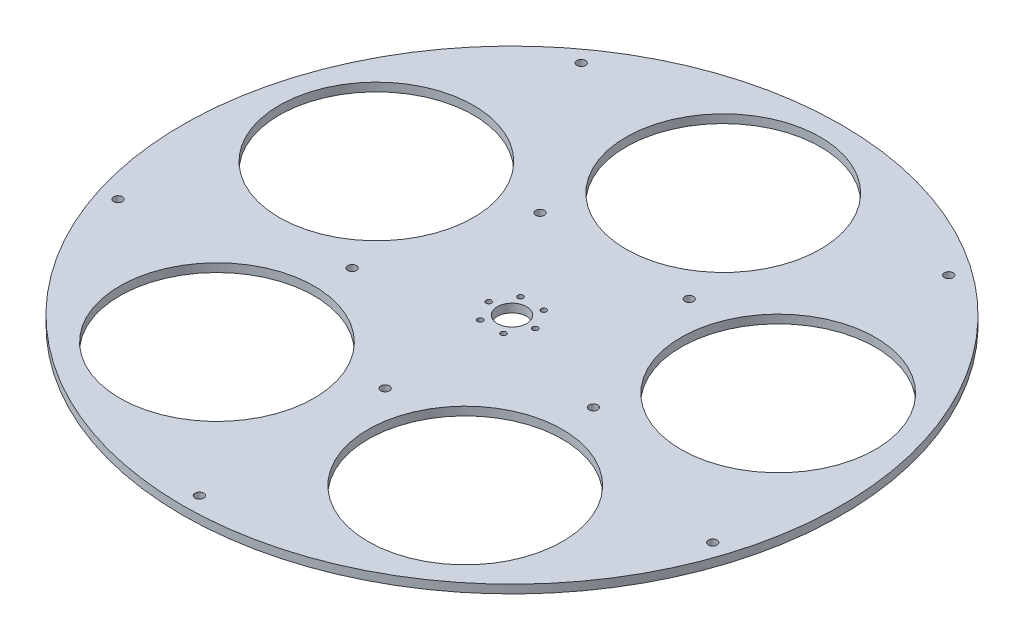
ISO-10303-21;
HEADER;
FILE_DESCRIPTION(('STEP AP214'),'2;1');
FILE_NAME('part.step','',(''),(''),'','','');
FILE_SCHEMA(('AUTOMOTIVE_DESIGN { 1 0 10303 214 1 1 1 1 }'));
ENDSEC;
DATA;
#1=APPLICATION_CONTEXT('core data for automotive mechanical design processes');
#2=APPLICATION_PROTOCOL_DEFINITION('international standard','automotive_design',2000,#1);
#3=PRODUCT_CONTEXT('',#1,'mechanical');
#4=PRODUCT('Part','Part','',(#3));
#5=PRODUCT_RELATED_PRODUCT_CATEGORY('part','',(#4));
#6=PRODUCT_DEFINITION_FORMATION('','',#4);
#7=PRODUCT_DEFINITION_CONTEXT('part definition',#1,'design');
#8=PRODUCT_DEFINITION('design','',#6,#7);
#9=PRODUCT_DEFINITION_SHAPE('','',#8);
#10=(LENGTH_UNIT() NAMED_UNIT(*) SI_UNIT(.MILLI.,.METRE.));
#11=(NAMED_UNIT(*) PLANE_ANGLE_UNIT() SI_UNIT($,.RADIAN.));
#12=(NAMED_UNIT(*) SI_UNIT($,.STERADIAN.) SOLID_ANGLE_UNIT());
#13=UNCERTAINTY_MEASURE_WITH_UNIT(LENGTH_MEASURE(1.E-05),#10,'distance_accuracy_value','');
#14=(GEOMETRIC_REPRESENTATION_CONTEXT(3) GLOBAL_UNCERTAINTY_ASSIGNED_CONTEXT((#13)) GLOBAL_UNIT_ASSIGNED_CONTEXT((#10,
#11,#12)) REPRESENTATION_CONTEXT('',''));
#15=CARTESIAN_POINT('',(0.,0.,0.));
#16=DIRECTION('',(0.,0.,1.));
#17=DIRECTION('',(1.,0.,0.));
#18=AXIS2_PLACEMENT_3D('',#15,#16,#17);
#19=CARTESIAN_POINT('',(0.,6.35,0.));
#20=DIRECTION('',(0.,1.,0.));
#21=DIRECTION('',(0.,0.,1.));
#22=AXIS2_PLACEMENT_3D('',#19,#20,#21);
#23=PLANE('',#22);
#24=CARTESIAN_POINT('',(90.6726821014121,6.35,29.4613403250134));
#25=DIRECTION('',(0.,1.,0.));
#26=DIRECTION('',(0.951056516295155,0.,0.309016994374945));
#27=AXIS2_PLACEMENT_3D('',#24,#25,#26);
#28=CIRCLE('',#27,3.2639);
#29=CARTESIAN_POINT('',(93.7768354649479,6.35,30.4699408929538));
#30=VERTEX_POINT('',#29);
#31=EDGE_CURVE('E178',#30,#30,#28,.T.);
#32=ORIENTED_EDGE('',*,*,#31,.F.);
#33=EDGE_LOOP('',(#32));
#34=FACE_BOUND('',#33,.T.);
#35=CARTESIAN_POINT('',(56.0387993897864,6.35,-77.130790325014));
#36=DIRECTION('',(0.,1.,0.));
#37=DIRECTION('',(0.587785252292469,0.,-0.809016994374951));
#38=AXIS2_PLACEMENT_3D('',#35,#36,#37);
#39=CIRCLE('',#38,3.2639);
#40=CARTESIAN_POINT('',(57.9572716747438,6.35,-79.7713408929544));
#41=VERTEX_POINT('',#40);
#42=EDGE_CURVE('E172',#41,#41,#39,.T.);
#43=ORIENTED_EDGE('',*,*,#42,.F.);
#44=EDGE_LOOP('',(#43));
#45=FACE_BOUND('',#44,.T.);
#46=CARTESIAN_POINT('',(-56.0387993897875,6.35,-77.1307903250132));
#47=DIRECTION('',(0.,1.,0.));
#48=DIRECTION('',(-0.58778525229248,0.,-0.809016994374942));
#49=AXIS2_PLACEMENT_3D('',#46,#47,#48);
#50=CIRCLE('',#49,3.2639);
#51=CARTESIAN_POINT('',(-57.957271674745,6.35,-79.7713408929535));
#52=VERTEX_POINT('',#51);
#53=EDGE_CURVE('E166',#52,#52,#50,.T.);
#54=ORIENTED_EDGE('',*,*,#53,.F.);
#55=EDGE_LOOP('',(#54));
#56=FACE_BOUND('',#55,.T.);
#57=CARTESIAN_POINT('',(-90.6726821014117,6.35,29.4613403250147));
#58=DIRECTION('',(0.,1.,0.));
#59=DIRECTION('',(-0.95105651629515,0.,0.309016994374958));
#60=AXIS2_PLACEMENT_3D('',#57,#58,#59);
#61=CIRCLE('',#60,3.2639);
#62=CARTESIAN_POINT('',(-93.7768354649474,6.35,30.4699408929551));
#63=VERTEX_POINT('',#62);
#64=EDGE_CURVE('E160',#63,#63,#61,.T.);
#65=ORIENTED_EDGE('',*,*,#64,.F.);
#66=EDGE_LOOP('',(#65));
#67=FACE_BOUND('',#66,.T.);
#68=CARTESIAN_POINT('',(0.,6.35,95.3389));
#69=DIRECTION('',(0.,1.,0.));
#70=DIRECTION('',(0.,0.,1.));
#71=AXIS2_PLACEMENT_3D('',#68,#69,#70);
#72=CIRCLE('',#71,3.2639);
#73=CARTESIAN_POINT('',(0.,6.35,98.6028));
#74=VERTEX_POINT('',#73);
#75=EDGE_CURVE('E154',#74,#74,#72,.T.);
#76=ORIENTED_EDGE('',*,*,#75,.F.);
#77=EDGE_LOOP('',(#76));
#78=FACE_BOUND('',#77,.T.);
#79=CARTESIAN_POINT('',(0.,6.35,234.95));
#80=DIRECTION('',(0.,1.,0.));
#81=DIRECTION('',(0.,0.,1.));
#82=AXIS2_PLACEMENT_3D('',#79,#80,#81);
#83=CIRCLE('',#82,3.2512);
#84=CARTESIAN_POINT('',(0.,6.35,238.2012));
#85=VERTEX_POINT('',#84);
#86=EDGE_CURVE('E149',#85,#85,#83,.T.);
#87=ORIENTED_EDGE('',*,*,#86,.F.);
#88=EDGE_LOOP('',(#87));
#89=FACE_BOUND('',#88,.T.);
#90=CARTESIAN_POINT('',(-223.450728503546,6.35,72.6035428283939));
#91=DIRECTION('',(0.,1.,0.));
#92=DIRECTION('',(0.,0.,1.));
#93=AXIS2_PLACEMENT_3D('',#90,#91,#92);
#94=CIRCLE('',#93,3.25120000000001);
#95=CARTESIAN_POINT('',(-223.450728503546,6.35,75.8547428283939));
#96=VERTEX_POINT('',#95);
#97=EDGE_CURVE('E143',#96,#96,#94,.T.);
#98=ORIENTED_EDGE('',*,*,#97,.F.);
#99=EDGE_LOOP('',(#98));
#100=FACE_BOUND('',#99,.T.);
#101=CARTESIAN_POINT('',(-138.100145026117,6.35,-190.078542828394));
#102=DIRECTION('',(0.,1.,0.));
#103=DIRECTION('',(0.,0.,1.));
#104=AXIS2_PLACEMENT_3D('',#101,#102,#103);
#105=CIRCLE('',#104,3.25120000000001);
#106=CARTESIAN_POINT('',(-138.100145026117,6.35,-186.827342828394));
#107=VERTEX_POINT('',#106);
#108=EDGE_CURVE('E137',#107,#107,#105,.T.);
#109=ORIENTED_EDGE('',*,*,#108,.F.);
#110=EDGE_LOOP('',(#109));
#111=FACE_BOUND('',#110,.T.);
#112=CARTESIAN_POINT('',(138.100145026117,6.35,-190.078542828394));
#113=DIRECTION('',(0.,1.,0.));
#114=DIRECTION('',(0.,0.,1.));
#115=AXIS2_PLACEMENT_3D('',#112,#113,#114);
#116=CIRCLE('',#115,3.25119999999998);
#117=CARTESIAN_POINT('',(138.100145026117,6.35,-186.827342828394));
#118=VERTEX_POINT('',#117);
#119=EDGE_CURVE('E131',#118,#118,#116,.T.);
#120=ORIENTED_EDGE('',*,*,#119,.F.);
#121=EDGE_LOOP('',(#120));
#122=FACE_BOUND('',#121,.T.);
#123=CARTESIAN_POINT('',(223.450728503546,6.35,72.6035428283939));
#124=DIRECTION('',(0.,1.,0.));
#125=DIRECTION('',(0.,0.,1.));
#126=AXIS2_PLACEMENT_3D('',#123,#124,#125);
#127=CIRCLE('',#126,3.25120000000001);
#128=CARTESIAN_POINT('',(223.450728503546,6.35,75.8547428283939));
#129=VERTEX_POINT('',#128);
#130=EDGE_CURVE('E124',#129,#129,#127,.T.);
#131=ORIENTED_EDGE('',*,*,#130,.F.);
#132=EDGE_LOOP('',(#131));
#133=FACE_BOUND('',#132,.T.);
#134=CARTESIAN_POINT('',(-8.73125000000002,6.35,-15.1229686135857));
#135=DIRECTION('',(0.,1.,0.));
#136=DIRECTION('',(0.,0.,1.));
#137=AXIS2_PLACEMENT_3D('',#134,#135,#136);
#138=CIRCLE('',#137,2.0193);
#139=CARTESIAN_POINT('',(-8.73125000000002,6.35,-13.1036686135857));
#140=VERTEX_POINT('',#139);
#141=EDGE_CURVE('E120',#140,#140,#138,.T.);
#142=ORIENTED_EDGE('',*,*,#141,.F.);
#143=EDGE_LOOP('',(#142));
#144=FACE_BOUND('',#143,.T.);
#145=CARTESIAN_POINT('',(8.73124999999997,6.35,-15.1229686135858));
#146=DIRECTION('',(0.,1.,0.));
#147=DIRECTION('',(0.,0.,1.));
#148=AXIS2_PLACEMENT_3D('',#145,#146,#147);
#149=CIRCLE('',#148,2.0193);
#150=CARTESIAN_POINT('',(8.73124999999997,6.35,-13.1036686135858));
#151=VERTEX_POINT('',#150);
#152=EDGE_CURVE('E114',#151,#151,#149,.T.);
#153=ORIENTED_EDGE('',*,*,#152,.F.);
#154=EDGE_LOOP('',(#153));
#155=FACE_BOUND('',#154,.T.);
#156=CARTESIAN_POINT('',(17.4625,6.35,0.));
#157=DIRECTION('',(0.,1.,0.));
#158=DIRECTION('',(0.,0.,1.));
#159=AXIS2_PLACEMENT_3D('',#156,#157,#158);
#160=CIRCLE('',#159,2.0193);
#161=CARTESIAN_POINT('',(17.4625,6.35,2.01929999999997));
#162=VERTEX_POINT('',#161);
#163=EDGE_CURVE('E108',#162,#162,#160,.T.);
#164=ORIENTED_EDGE('',*,*,#163,.F.);
#165=EDGE_LOOP('',(#164));
#166=FACE_BOUND('',#165,.T.);
#167=CARTESIAN_POINT('',(8.73125000000002,6.35,15.1229686135857));
#168=DIRECTION('',(0.,1.,0.));
#169=DIRECTION('',(0.,0.,1.));
#170=AXIS2_PLACEMENT_3D('',#167,#168,#169);
#171=CIRCLE('',#170,2.0193);
#172=CARTESIAN_POINT('',(8.73125000000002,6.35,17.1422686135857));
#173=VERTEX_POINT('',#172);
#174=EDGE_CURVE('E102',#173,#173,#171,.T.);
#175=ORIENTED_EDGE('',*,*,#174,.F.);
#176=EDGE_LOOP('',(#175));
#177=FACE_BOUND('',#176,.T.);
#178=CARTESIAN_POINT('',(-8.73124999999997,6.35,15.1229686135858));
#179=DIRECTION('',(0.,1.,0.));
#180=DIRECTION('',(0.,0.,1.));
#181=AXIS2_PLACEMENT_3D('',#178,#179,#180);
#182=CIRCLE('',#181,2.0193);
#183=CARTESIAN_POINT('',(-8.73124999999997,6.35,17.1422686135858));
#184=VERTEX_POINT('',#183);
#185=EDGE_CURVE('E96',#184,#184,#182,.T.);
#186=ORIENTED_EDGE('',*,*,#185,.F.);
#187=EDGE_LOOP('',(#186));
#188=FACE_BOUND('',#187,.T.);
#189=CARTESIAN_POINT('',(-17.4625,6.35,0.));
#190=DIRECTION('',(0.,1.,0.));
#191=DIRECTION('',(0.,0.,1.));
#192=AXIS2_PLACEMENT_3D('',#189,#190,#191);
#193=CIRCLE('',#192,2.0193);
#194=CARTESIAN_POINT('',(-17.4625,6.35,2.01930000000002));
#195=VERTEX_POINT('',#194);
#196=EDGE_CURVE('E90',#195,#195,#193,.T.);
#197=ORIENTED_EDGE('',*,*,#196,.F.);
#198=EDGE_LOOP('',(#197));
#199=FACE_BOUND('',#198,.T.);
#200=CARTESIAN_POINT('',(0.,6.35,0.));
#201=DIRECTION('',(0.,1.,0.));
#202=DIRECTION('',(0.,0.,1.));
#203=AXIS2_PLACEMENT_3D('',#200,#201,#202);
#204=CIRCLE('',#203,11.);
#205=CARTESIAN_POINT('',(0.,6.35,11.));
#206=VERTEX_POINT('',#205);
#207=EDGE_CURVE('E82',#206,#206,#204,.T.);
#208=ORIENTED_EDGE('',*,*,#207,.F.);
#209=EDGE_LOOP('',(#208));
#210=FACE_BOUND('',#209,.T.);
#211=CARTESIAN_POINT('',(-93.3109088014179,6.35,128.431447857027));
#212=DIRECTION('',(0.,1.,0.));
#213=DIRECTION('',(0.,0.,1.));
#214=AXIS2_PLACEMENT_3D('',#211,#212,#213);
#215=CIRCLE('',#214,73.025);
#216=CARTESIAN_POINT('',(-93.3109088014179,6.35,201.456447857027));
#217=VERTEX_POINT('',#216);
#218=EDGE_CURVE('E67',#217,#217,#215,.T.);
#219=ORIENTED_EDGE('',*,*,#218,.F.);
#220=EDGE_LOOP('',(#219));
#221=FACE_BOUND('',#220,.T.);
#222=CARTESIAN_POINT('',(150.98022196186,6.35,-49.0564478570293));
#223=DIRECTION('',(0.,1.,0.));
#224=DIRECTION('',(0.,0.,1.));
#225=AXIS2_PLACEMENT_3D('',#222,#223,#224);
#226=CIRCLE('',#225,73.025);
#227=CARTESIAN_POINT('',(150.98022196186,6.35,23.9685521429707));
#228=VERTEX_POINT('',#227);
#229=EDGE_CURVE('E55',#228,#228,#226,.T.);
#230=ORIENTED_EDGE('',*,*,#229,.F.);
#231=EDGE_LOOP('',(#230));
#232=FACE_BOUND('',#231,.T.);
#233=CARTESIAN_POINT('',(0.,6.35,0.));
#234=DIRECTION('',(0.,1.,0.));
#235=DIRECTION('',(0.,0.,1.));
#236=AXIS2_PLACEMENT_3D('',#233,#234,#235);
#237=CIRCLE('',#236,247.65);
#238=CARTESIAN_POINT('',(0.,6.35,247.65));
#239=VERTEX_POINT('',#238);
#240=EDGE_CURVE('E10',#239,#239,#237,.T.);
#241=ORIENTED_EDGE('',*,*,#240,.T.);
#242=EDGE_LOOP('',(#241));
#243=FACE_BOUND('',#242,.T.);
#244=CARTESIAN_POINT('',(0.,6.35,-158.75));
#245=DIRECTION('',(0.,1.,0.));
#246=DIRECTION('',(0.,0.,1.));
#247=AXIS2_PLACEMENT_3D('',#244,#245,#246);
#248=CIRCLE('',#247,73.025);
#249=CARTESIAN_POINT('',(0.,6.35,-85.725));
#250=VERTEX_POINT('',#249);
#251=EDGE_CURVE('E50',#250,#250,#248,.T.);
#252=ORIENTED_EDGE('',*,*,#251,.F.);
#253=EDGE_LOOP('',(#252));
#254=FACE_BOUND('',#253,.T.);
#255=CARTESIAN_POINT('',(93.3109088014423,6.35,128.431447857019));
#256=DIRECTION('',(0.,1.,0.));
#257=DIRECTION('',(0.,0.,1.));
#258=AXIS2_PLACEMENT_3D('',#255,#256,#257);
#259=CIRCLE('',#258,73.025);
#260=CARTESIAN_POINT('',(93.3109088014423,6.35,201.456447857019));
#261=VERTEX_POINT('',#260);
#262=EDGE_CURVE('E61',#261,#261,#259,.T.);
#263=ORIENTED_EDGE('',*,*,#262,.F.);
#264=EDGE_LOOP('',(#263));
#265=FACE_BOUND('',#264,.T.);
#266=CARTESIAN_POINT('',(-150.980221961851,6.35,-49.0564478570165));
#267=DIRECTION('',(0.,1.,0.));
#268=DIRECTION('',(0.,0.,1.));
#269=AXIS2_PLACEMENT_3D('',#266,#267,#268);
#270=CIRCLE('',#269,73.025);
#271=CARTESIAN_POINT('',(-150.980221961851,6.35,23.9685521429835));
#272=VERTEX_POINT('',#271);
#273=EDGE_CURVE('E73',#272,#272,#270,.T.);
#274=ORIENTED_EDGE('',*,*,#273,.F.);
#275=EDGE_LOOP('',(#274));
#276=FACE_BOUND('',#275,.T.);
#277=ADVANCED_FACE('F39',(#34,#45,#56,#67,#78,#89,#100,#111,#122,#133,#144,#155,#166,#177,#188,
#199,#210,#221,#232,#243,#254,#265,#276),#23,.T.);
#278=CARTESIAN_POINT('',(0.,0.,0.));
#279=DIRECTION('',(0.,1.,0.));
#280=DIRECTION('',(0.,0.,1.));
#281=AXIS2_PLACEMENT_3D('',#278,#279,#280);
#282=PLANE('',#281);
#283=CARTESIAN_POINT('',(90.6726821014121,0.,29.4613403250134));
#284=DIRECTION('',(0.,1.,0.));
#285=DIRECTION('',(0.951056516295155,0.,0.309016994374945));
#286=AXIS2_PLACEMENT_3D('',#283,#284,#285);
#287=CIRCLE('',#286,3.2639);
#288=CARTESIAN_POINT('',(93.7768354649479,0.,30.4699408929538));
#289=VERTEX_POINT('',#288);
#290=EDGE_CURVE('E157',#289,#289,#287,.T.);
#291=ORIENTED_EDGE('',*,*,#290,.T.);
#292=EDGE_LOOP('',(#291));
#293=FACE_BOUND('',#292,.T.);
#294=CARTESIAN_POINT('',(56.0387993897864,0.,-77.130790325014));
#295=DIRECTION('',(0.,1.,0.));
#296=DIRECTION('',(0.587785252292469,0.,-0.809016994374951));
#297=AXIS2_PLACEMENT_3D('',#294,#295,#296);
#298=CIRCLE('',#297,3.2639);
#299=CARTESIAN_POINT('',(57.9572716747438,0.,-79.7713408929544));
#300=VERTEX_POINT('',#299);
#301=EDGE_CURVE('E175',#300,#300,#298,.T.);
#302=ORIENTED_EDGE('',*,*,#301,.T.);
#303=EDGE_LOOP('',(#302));
#304=FACE_BOUND('',#303,.T.);
#305=CARTESIAN_POINT('',(-56.0387993897875,0.,-77.1307903250132));
#306=DIRECTION('',(0.,1.,0.));
#307=DIRECTION('',(-0.58778525229248,0.,-0.809016994374942));
#308=AXIS2_PLACEMENT_3D('',#305,#306,#307);
#309=CIRCLE('',#308,3.2639);
#310=CARTESIAN_POINT('',(-57.957271674745,0.,-79.7713408929535));
#311=VERTEX_POINT('',#310);
#312=EDGE_CURVE('E169',#311,#311,#309,.T.);
#313=ORIENTED_EDGE('',*,*,#312,.T.);
#314=EDGE_LOOP('',(#313));
#315=FACE_BOUND('',#314,.T.);
#316=CARTESIAN_POINT('',(-90.6726821014117,0.,29.4613403250147));
#317=DIRECTION('',(0.,1.,0.));
#318=DIRECTION('',(-0.95105651629515,0.,0.309016994374958));
#319=AXIS2_PLACEMENT_3D('',#316,#317,#318);
#320=CIRCLE('',#319,3.2639);
#321=CARTESIAN_POINT('',(-93.7768354649474,0.,30.4699408929551));
#322=VERTEX_POINT('',#321);
#323=EDGE_CURVE('E163',#322,#322,#320,.T.);
#324=ORIENTED_EDGE('',*,*,#323,.T.);
#325=EDGE_LOOP('',(#324));
#326=FACE_BOUND('',#325,.T.);
#327=CARTESIAN_POINT('',(0.,0.,95.3389));
#328=DIRECTION('',(0.,1.,0.));
#329=DIRECTION('',(0.,0.,1.));
#330=AXIS2_PLACEMENT_3D('',#327,#328,#329);
#331=CIRCLE('',#330,3.2639);
#332=CARTESIAN_POINT('',(0.,0.,98.6028));
#333=VERTEX_POINT('',#332);
#334=EDGE_CURVE('E128',#333,#333,#331,.T.);
#335=ORIENTED_EDGE('',*,*,#334,.T.);
#336=EDGE_LOOP('',(#335));
#337=FACE_BOUND('',#336,.T.);
#338=CARTESIAN_POINT('',(0.,0.,234.95));
#339=DIRECTION('',(0.,1.,0.));
#340=DIRECTION('',(0.,0.,1.));
#341=AXIS2_PLACEMENT_3D('',#338,#339,#340);
#342=CIRCLE('',#341,3.2512);
#343=CARTESIAN_POINT('',(0.,0.,238.2012));
#344=VERTEX_POINT('',#343);
#345=EDGE_CURVE('E123',#344,#344,#342,.T.);
#346=ORIENTED_EDGE('',*,*,#345,.T.);
#347=EDGE_LOOP('',(#346));
#348=FACE_BOUND('',#347,.T.);
#349=CARTESIAN_POINT('',(-223.450728503546,0.,72.6035428283939));
#350=DIRECTION('',(0.,1.,0.));
#351=DIRECTION('',(0.,0.,1.));
#352=AXIS2_PLACEMENT_3D('',#349,#350,#351);
#353=CIRCLE('',#352,3.25120000000001);
#354=CARTESIAN_POINT('',(-223.450728503546,0.,75.8547428283939));
#355=VERTEX_POINT('',#354);
#356=EDGE_CURVE('E146',#355,#355,#353,.T.);
#357=ORIENTED_EDGE('',*,*,#356,.T.);
#358=EDGE_LOOP('',(#357));
#359=FACE_BOUND('',#358,.T.);
#360=CARTESIAN_POINT('',(-138.100145026117,0.,-190.078542828394));
#361=DIRECTION('',(0.,1.,0.));
#362=DIRECTION('',(0.,0.,1.));
#363=AXIS2_PLACEMENT_3D('',#360,#361,#362);
#364=CIRCLE('',#363,3.25120000000001);
#365=CARTESIAN_POINT('',(-138.100145026117,0.,-186.827342828394));
#366=VERTEX_POINT('',#365);
#367=EDGE_CURVE('E140',#366,#366,#364,.T.);
#368=ORIENTED_EDGE('',*,*,#367,.T.);
#369=EDGE_LOOP('',(#368));
#370=FACE_BOUND('',#369,.T.);
#371=CARTESIAN_POINT('',(138.100145026117,0.,-190.078542828394));
#372=DIRECTION('',(0.,1.,0.));
#373=DIRECTION('',(0.,0.,1.));
#374=AXIS2_PLACEMENT_3D('',#371,#372,#373);
#375=CIRCLE('',#374,3.25119999999998);
#376=CARTESIAN_POINT('',(138.100145026117,0.,-186.827342828394));
#377=VERTEX_POINT('',#376);
#378=EDGE_CURVE('E134',#377,#377,#375,.T.);
#379=ORIENTED_EDGE('',*,*,#378,.T.);
#380=EDGE_LOOP('',(#379));
#381=FACE_BOUND('',#380,.T.);
#382=CARTESIAN_POINT('',(223.450728503546,0.,72.6035428283939));
#383=DIRECTION('',(0.,1.,0.));
#384=DIRECTION('',(0.,0.,1.));
#385=AXIS2_PLACEMENT_3D('',#382,#383,#384);
#386=CIRCLE('',#385,3.25120000000001);
#387=CARTESIAN_POINT('',(223.450728503546,0.,75.8547428283939));
#388=VERTEX_POINT('',#387);
#389=EDGE_CURVE('E127',#388,#388,#386,.T.);
#390=ORIENTED_EDGE('',*,*,#389,.T.);
#391=EDGE_LOOP('',(#390));
#392=FACE_BOUND('',#391,.T.);
#393=CARTESIAN_POINT('',(-8.73125000000002,0.,-15.1229686135857));
#394=DIRECTION('',(0.,1.,0.));
#395=DIRECTION('',(0.,0.,1.));
#396=AXIS2_PLACEMENT_3D('',#393,#394,#395);
#397=CIRCLE('',#396,2.0193);
#398=CARTESIAN_POINT('',(-8.73125000000002,0.,-13.1036686135857));
#399=VERTEX_POINT('',#398);
#400=EDGE_CURVE('E117',#399,#399,#397,.T.);
#401=ORIENTED_EDGE('',*,*,#400,.T.);
#402=EDGE_LOOP('',(#401));
#403=FACE_BOUND('',#402,.T.);
#404=CARTESIAN_POINT('',(8.73124999999997,0.,-15.1229686135858));
#405=DIRECTION('',(0.,1.,0.));
#406=DIRECTION('',(0.,0.,1.));
#407=AXIS2_PLACEMENT_3D('',#404,#405,#406);
#408=CIRCLE('',#407,2.0193);
#409=CARTESIAN_POINT('',(8.73124999999997,0.,-13.1036686135858));
#410=VERTEX_POINT('',#409);
#411=EDGE_CURVE('E111',#410,#410,#408,.T.);
#412=ORIENTED_EDGE('',*,*,#411,.T.);
#413=EDGE_LOOP('',(#412));
#414=FACE_BOUND('',#413,.T.);
#415=CARTESIAN_POINT('',(17.4625,0.,0.));
#416=DIRECTION('',(0.,1.,0.));
#417=DIRECTION('',(0.,0.,1.));
#418=AXIS2_PLACEMENT_3D('',#415,#416,#417);
#419=CIRCLE('',#418,2.0193);
#420=CARTESIAN_POINT('',(17.4625,0.,2.01929999999997));
#421=VERTEX_POINT('',#420);
#422=EDGE_CURVE('E105',#421,#421,#419,.T.);
#423=ORIENTED_EDGE('',*,*,#422,.T.);
#424=EDGE_LOOP('',(#423));
#425=FACE_BOUND('',#424,.T.);
#426=CARTESIAN_POINT('',(8.73125000000002,0.,15.1229686135857));
#427=DIRECTION('',(0.,1.,0.));
#428=DIRECTION('',(0.,0.,1.));
#429=AXIS2_PLACEMENT_3D('',#426,#427,#428);
#430=CIRCLE('',#429,2.0193);
#431=CARTESIAN_POINT('',(8.73125000000002,0.,17.1422686135857));
#432=VERTEX_POINT('',#431);
#433=EDGE_CURVE('E99',#432,#432,#430,.T.);
#434=ORIENTED_EDGE('',*,*,#433,.T.);
#435=EDGE_LOOP('',(#434));
#436=FACE_BOUND('',#435,.T.);
#437=CARTESIAN_POINT('',(-8.73124999999997,0.,15.1229686135858));
#438=DIRECTION('',(0.,1.,0.));
#439=DIRECTION('',(0.,0.,1.));
#440=AXIS2_PLACEMENT_3D('',#437,#438,#439);
#441=CIRCLE('',#440,2.0193);
#442=CARTESIAN_POINT('',(-8.73124999999997,0.,17.1422686135858));
#443=VERTEX_POINT('',#442);
#444=EDGE_CURVE('E93',#443,#443,#441,.T.);
#445=ORIENTED_EDGE('',*,*,#444,.T.);
#446=EDGE_LOOP('',(#445));
#447=FACE_BOUND('',#446,.T.);
#448=CARTESIAN_POINT('',(-17.4625,0.,0.));
#449=DIRECTION('',(0.,1.,0.));
#450=DIRECTION('',(0.,0.,1.));
#451=AXIS2_PLACEMENT_3D('',#448,#449,#450);
#452=CIRCLE('',#451,2.0193);
#453=CARTESIAN_POINT('',(-17.4625,0.,2.01930000000002));
#454=VERTEX_POINT('',#453);
#455=EDGE_CURVE('E85',#454,#454,#452,.T.);
#456=ORIENTED_EDGE('',*,*,#455,.T.);
#457=EDGE_LOOP('',(#456));
#458=FACE_BOUND('',#457,.T.);
#459=CARTESIAN_POINT('',(0.,0.,0.));
#460=DIRECTION('',(0.,1.,0.));
#461=DIRECTION('',(0.,0.,1.));
#462=AXIS2_PLACEMENT_3D('',#459,#460,#461);
#463=CIRCLE('',#462,11.);
#464=CARTESIAN_POINT('',(0.,0.,11.));
#465=VERTEX_POINT('',#464);
#466=EDGE_CURVE('E79',#465,#465,#463,.T.);
#467=ORIENTED_EDGE('',*,*,#466,.T.);
#468=EDGE_LOOP('',(#467));
#469=FACE_BOUND('',#468,.T.);
#470=CARTESIAN_POINT('',(0.,0.,0.));
#471=DIRECTION('',(0.,1.,0.));
#472=DIRECTION('',(0.,0.,1.));
#473=AXIS2_PLACEMENT_3D('',#470,#471,#472);
#474=CIRCLE('',#473,247.65);
#475=CARTESIAN_POINT('',(0.,0.,247.65));
#476=VERTEX_POINT('',#475);
#477=EDGE_CURVE('E43',#476,#476,#474,.T.);
#478=ORIENTED_EDGE('',*,*,#477,.F.);
#479=EDGE_LOOP('',(#478));
#480=FACE_BOUND('',#479,.T.);
#481=CARTESIAN_POINT('',(0.,0.,-158.75));
#482=DIRECTION('',(0.,1.,0.));
#483=DIRECTION('',(0.,0.,1.));
#484=AXIS2_PLACEMENT_3D('',#481,#482,#483);
#485=CIRCLE('',#484,73.025);
#486=CARTESIAN_POINT('',(0.,0.,-85.725));
#487=VERTEX_POINT('',#486);
#488=EDGE_CURVE('E52',#487,#487,#485,.T.);
#489=ORIENTED_EDGE('',*,*,#488,.T.);
#490=EDGE_LOOP('',(#489));
#491=FACE_BOUND('',#490,.T.);
#492=CARTESIAN_POINT('',(150.98022196186,0.,-49.0564478570293));
#493=DIRECTION('',(0.,1.,0.));
#494=DIRECTION('',(0.,0.,1.));
#495=AXIS2_PLACEMENT_3D('',#492,#493,#494);
#496=CIRCLE('',#495,73.025);
#497=CARTESIAN_POINT('',(150.98022196186,0.,23.9685521429707));
#498=VERTEX_POINT('',#497);
#499=EDGE_CURVE('E58',#498,#498,#496,.T.);
#500=ORIENTED_EDGE('',*,*,#499,.T.);
#501=EDGE_LOOP('',(#500));
#502=FACE_BOUND('',#501,.T.);
#503=CARTESIAN_POINT('',(93.3109088014423,0.,128.431447857019));
#504=DIRECTION('',(0.,1.,0.));
#505=DIRECTION('',(0.,0.,1.));
#506=AXIS2_PLACEMENT_3D('',#503,#504,#505);
#507=CIRCLE('',#506,73.025);
#508=CARTESIAN_POINT('',(93.3109088014423,0.,201.456447857019));
#509=VERTEX_POINT('',#508);
#510=EDGE_CURVE('E64',#509,#509,#507,.T.);
#511=ORIENTED_EDGE('',*,*,#510,.T.);
#512=EDGE_LOOP('',(#511));
#513=FACE_BOUND('',#512,.T.);
#514=CARTESIAN_POINT('',(-93.3109088014179,0.,128.431447857027));
#515=DIRECTION('',(0.,1.,0.));
#516=DIRECTION('',(0.,0.,1.));
#517=AXIS2_PLACEMENT_3D('',#514,#515,#516);
#518=CIRCLE('',#517,73.025);
#519=CARTESIAN_POINT('',(-93.3109088014179,0.,201.456447857027));
#520=VERTEX_POINT('',#519);
#521=EDGE_CURVE('E70',#520,#520,#518,.T.);
#522=ORIENTED_EDGE('',*,*,#521,.T.);
#523=EDGE_LOOP('',(#522));
#524=FACE_BOUND('',#523,.T.);
#525=CARTESIAN_POINT('',(-150.980221961851,0.,-49.0564478570165));
#526=DIRECTION('',(0.,1.,0.));
#527=DIRECTION('',(0.,0.,1.));
#528=AXIS2_PLACEMENT_3D('',#525,#526,#527);
#529=CIRCLE('',#528,73.025);
#530=CARTESIAN_POINT('',(-150.980221961851,0.,23.9685521429835));
#531=VERTEX_POINT('',#530);
#532=EDGE_CURVE('E76',#531,#531,#529,.T.);
#533=ORIENTED_EDGE('',*,*,#532,.T.);
#534=EDGE_LOOP('',(#533));
#535=FACE_BOUND('',#534,.T.);
#536=ADVANCED_FACE('F184',(#293,#304,#315,#326,#337,#348,#359,#370,#381,#392,#403,#414,#425,
#436,#447,#458,#469,#480,#491,#502,#513,#524,#535),#282,.F.);
#537=CARTESIAN_POINT('',(0.,6.35,0.));
#538=DIRECTION('',(0.,-1.,0.));
#539=DIRECTION('',(0.,0.,-1.));
#540=AXIS2_PLACEMENT_3D('',#537,#538,#539);
#541=CYLINDRICAL_SURFACE('',#540,247.65);
#542=ORIENTED_EDGE('',*,*,#240,.F.);
#543=EDGE_LOOP('',(#542));
#544=FACE_BOUND('',#543,.T.);
#545=ORIENTED_EDGE('',*,*,#477,.T.);
#546=EDGE_LOOP('',(#545));
#547=FACE_BOUND('',#546,.T.);
#548=ADVANCED_FACE('F41',(#544,#547),#541,.T.);
#549=CARTESIAN_POINT('',(0.,6.35,-158.75));
#550=DIRECTION('',(0.,-1.,0.));
#551=DIRECTION('',(0.,0.,-1.));
#552=AXIS2_PLACEMENT_3D('',#549,#550,#551);
#553=CYLINDRICAL_SURFACE('',#552,73.025);
#554=ORIENTED_EDGE('',*,*,#251,.T.);
#555=EDGE_LOOP('',(#554));
#556=FACE_BOUND('',#555,.T.);
#557=ORIENTED_EDGE('',*,*,#488,.F.);
#558=EDGE_LOOP('',(#557));
#559=FACE_BOUND('',#558,.T.);
#560=ADVANCED_FACE('F251',(#556,#559),#553,.F.);
#561=CARTESIAN_POINT('',(150.98022196186,6.35,-49.0564478570293));
#562=DIRECTION('',(0.,-1.,0.));
#563=DIRECTION('',(0.,0.,-1.));
#564=AXIS2_PLACEMENT_3D('',#561,#562,#563);
#565=CYLINDRICAL_SURFACE('',#564,73.025);
#566=ORIENTED_EDGE('',*,*,#229,.T.);
#567=EDGE_LOOP('',(#566));
#568=FACE_BOUND('',#567,.T.);
#569=ORIENTED_EDGE('',*,*,#499,.F.);
#570=EDGE_LOOP('',(#569));
#571=FACE_BOUND('',#570,.T.);
#572=ADVANCED_FACE('F256',(#568,#571),#565,.F.);
#573=CARTESIAN_POINT('',(93.3109088014423,6.35,128.431447857019));
#574=DIRECTION('',(0.,-1.,0.));
#575=DIRECTION('',(0.,0.,-1.));
#576=AXIS2_PLACEMENT_3D('',#573,#574,#575);
#577=CYLINDRICAL_SURFACE('',#576,73.025);
#578=ORIENTED_EDGE('',*,*,#262,.T.);
#579=EDGE_LOOP('',(#578));
#580=FACE_BOUND('',#579,.T.);
#581=ORIENTED_EDGE('',*,*,#510,.F.);
#582=EDGE_LOOP('',(#581));
#583=FACE_BOUND('',#582,.T.);
#584=ADVANCED_FACE('F260',(#580,#583),#577,.F.);
#585=CARTESIAN_POINT('',(-93.3109088014179,6.35,128.431447857027));
#586=DIRECTION('',(0.,-1.,0.));
#587=DIRECTION('',(0.,0.,-1.));
#588=AXIS2_PLACEMENT_3D('',#585,#586,#587);
#589=CYLINDRICAL_SURFACE('',#588,73.025);
#590=ORIENTED_EDGE('',*,*,#218,.T.);
#591=EDGE_LOOP('',(#590));
#592=FACE_BOUND('',#591,.T.);
#593=ORIENTED_EDGE('',*,*,#521,.F.);
#594=EDGE_LOOP('',(#593));
#595=FACE_BOUND('',#594,.T.);
#596=ADVANCED_FACE('F243',(#592,#595),#589,.F.);
#597=CARTESIAN_POINT('',(-150.980221961851,6.35,-49.0564478570165));
#598=DIRECTION('',(0.,-1.,0.));
#599=DIRECTION('',(0.,0.,-1.));
#600=AXIS2_PLACEMENT_3D('',#597,#598,#599);
#601=CYLINDRICAL_SURFACE('',#600,73.025);
#602=ORIENTED_EDGE('',*,*,#273,.T.);
#603=EDGE_LOOP('',(#602));
#604=FACE_BOUND('',#603,.T.);
#605=ORIENTED_EDGE('',*,*,#532,.F.);
#606=EDGE_LOOP('',(#605));
#607=FACE_BOUND('',#606,.T.);
#608=ADVANCED_FACE('F239',(#604,#607),#601,.F.);
#609=CARTESIAN_POINT('',(0.,0.,0.));
#610=DIRECTION('',(0.,1.,0.));
#611=DIRECTION('',(0.,0.,1.));
#612=AXIS2_PLACEMENT_3D('',#609,#610,#611);
#613=CYLINDRICAL_SURFACE('',#612,11.);
#614=ORIENTED_EDGE('',*,*,#466,.F.);
#615=EDGE_LOOP('',(#614));
#616=FACE_BOUND('',#615,.T.);
#617=ORIENTED_EDGE('',*,*,#207,.T.);
#618=EDGE_LOOP('',(#617));
#619=FACE_BOUND('',#618,.T.);
#620=ADVANCED_FACE('F242',(#616,#619),#613,.F.);
#621=CARTESIAN_POINT('',(-17.4625,6.35,0.));
#622=DIRECTION('',(0.,1.,0.));
#623=DIRECTION('',(0.,0.,1.));
#624=AXIS2_PLACEMENT_3D('',#621,#622,#623);
#625=CYLINDRICAL_SURFACE('',#624,2.0193);
#626=ORIENTED_EDGE('',*,*,#455,.F.);
#627=EDGE_LOOP('',(#626));
#628=FACE_BOUND('',#627,.T.);
#629=ORIENTED_EDGE('',*,*,#196,.T.);
#630=EDGE_LOOP('',(#629));
#631=FACE_BOUND('',#630,.T.);
#632=ADVANCED_FACE('F270',(#628,#631),#625,.F.);
#633=CARTESIAN_POINT('',(-8.73124999999997,6.35,15.1229686135858));
#634=DIRECTION('',(0.,1.,0.));
#635=DIRECTION('',(0.,0.,1.));
#636=AXIS2_PLACEMENT_3D('',#633,#634,#635);
#637=CYLINDRICAL_SURFACE('',#636,2.0193);
#638=ORIENTED_EDGE('',*,*,#444,.F.);
#639=EDGE_LOOP('',(#638));
#640=FACE_BOUND('',#639,.T.);
#641=ORIENTED_EDGE('',*,*,#185,.T.);
#642=EDGE_LOOP('',(#641));
#643=FACE_BOUND('',#642,.T.);
#644=ADVANCED_FACE('F274',(#640,#643),#637,.F.);
#645=CARTESIAN_POINT('',(8.73125000000002,6.35,15.1229686135857));
#646=DIRECTION('',(0.,1.,0.));
#647=DIRECTION('',(0.,0.,1.));
#648=AXIS2_PLACEMENT_3D('',#645,#646,#647);
#649=CYLINDRICAL_SURFACE('',#648,2.0193);
#650=ORIENTED_EDGE('',*,*,#433,.F.);
#651=EDGE_LOOP('',(#650));
#652=FACE_BOUND('',#651,.T.);
#653=ORIENTED_EDGE('',*,*,#174,.T.);
#654=EDGE_LOOP('',(#653));
#655=FACE_BOUND('',#654,.T.);
#656=ADVANCED_FACE('F278',(#652,#655),#649,.F.);
#657=CARTESIAN_POINT('',(17.4625,6.35,0.));
#658=DIRECTION('',(0.,1.,0.));
#659=DIRECTION('',(0.,0.,1.));
#660=AXIS2_PLACEMENT_3D('',#657,#658,#659);
#661=CYLINDRICAL_SURFACE('',#660,2.0193);
#662=ORIENTED_EDGE('',*,*,#422,.F.);
#663=EDGE_LOOP('',(#662));
#664=FACE_BOUND('',#663,.T.);
#665=ORIENTED_EDGE('',*,*,#163,.T.);
#666=EDGE_LOOP('',(#665));
#667=FACE_BOUND('',#666,.T.);
#668=ADVANCED_FACE('F282',(#664,#667),#661,.F.);
#669=CARTESIAN_POINT('',(8.73124999999997,6.35,-15.1229686135858));
#670=DIRECTION('',(0.,1.,0.));
#671=DIRECTION('',(0.,0.,1.));
#672=AXIS2_PLACEMENT_3D('',#669,#670,#671);
#673=CYLINDRICAL_SURFACE('',#672,2.0193);
#674=ORIENTED_EDGE('',*,*,#411,.F.);
#675=EDGE_LOOP('',(#674));
#676=FACE_BOUND('',#675,.T.);
#677=ORIENTED_EDGE('',*,*,#152,.T.);
#678=EDGE_LOOP('',(#677));
#679=FACE_BOUND('',#678,.T.);
#680=ADVANCED_FACE('F286',(#676,#679),#673,.F.);
#681=CARTESIAN_POINT('',(-8.73125000000002,6.35,-15.1229686135857));
#682=DIRECTION('',(0.,1.,0.));
#683=DIRECTION('',(0.,0.,1.));
#684=AXIS2_PLACEMENT_3D('',#681,#682,#683);
#685=CYLINDRICAL_SURFACE('',#684,2.0193);
#686=ORIENTED_EDGE('',*,*,#400,.F.);
#687=EDGE_LOOP('',(#686));
#688=FACE_BOUND('',#687,.T.);
#689=ORIENTED_EDGE('',*,*,#141,.T.);
#690=EDGE_LOOP('',(#689));
#691=FACE_BOUND('',#690,.T.);
#692=ADVANCED_FACE('F290',(#688,#691),#685,.F.);
#693=CARTESIAN_POINT('',(223.450728503546,0.,72.6035428283939));
#694=DIRECTION('',(0.,1.,0.));
#695=DIRECTION('',(0.,0.,1.));
#696=AXIS2_PLACEMENT_3D('',#693,#694,#695);
#697=CYLINDRICAL_SURFACE('',#696,3.25120000000001);
#698=ORIENTED_EDGE('',*,*,#389,.F.);
#699=EDGE_LOOP('',(#698));
#700=FACE_BOUND('',#699,.T.);
#701=ORIENTED_EDGE('',*,*,#130,.T.);
#702=EDGE_LOOP('',(#701));
#703=FACE_BOUND('',#702,.T.);
#704=ADVANCED_FACE('F294',(#700,#703),#697,.F.);
#705=CARTESIAN_POINT('',(138.100145026117,0.,-190.078542828394));
#706=DIRECTION('',(0.,1.,0.));
#707=DIRECTION('',(0.,0.,1.));
#708=AXIS2_PLACEMENT_3D('',#705,#706,#707);
#709=CYLINDRICAL_SURFACE('',#708,3.25119999999998);
#710=ORIENTED_EDGE('',*,*,#378,.F.);
#711=EDGE_LOOP('',(#710));
#712=FACE_BOUND('',#711,.T.);
#713=ORIENTED_EDGE('',*,*,#119,.T.);
#714=EDGE_LOOP('',(#713));
#715=FACE_BOUND('',#714,.T.);
#716=ADVANCED_FACE('F298',(#712,#715),#709,.F.);
#717=CARTESIAN_POINT('',(-138.100145026117,0.,-190.078542828394));
#718=DIRECTION('',(0.,1.,0.));
#719=DIRECTION('',(0.,0.,1.));
#720=AXIS2_PLACEMENT_3D('',#717,#718,#719);
#721=CYLINDRICAL_SURFACE('',#720,3.25120000000001);
#722=ORIENTED_EDGE('',*,*,#367,.F.);
#723=EDGE_LOOP('',(#722));
#724=FACE_BOUND('',#723,.T.);
#725=ORIENTED_EDGE('',*,*,#108,.T.);
#726=EDGE_LOOP('',(#725));
#727=FACE_BOUND('',#726,.T.);
#728=ADVANCED_FACE('F302',(#724,#727),#721,.F.);
#729=CARTESIAN_POINT('',(-223.450728503546,0.,72.6035428283939));
#730=DIRECTION('',(0.,1.,0.));
#731=DIRECTION('',(0.,0.,1.));
#732=AXIS2_PLACEMENT_3D('',#729,#730,#731);
#733=CYLINDRICAL_SURFACE('',#732,3.25120000000001);
#734=ORIENTED_EDGE('',*,*,#356,.F.);
#735=EDGE_LOOP('',(#734));
#736=FACE_BOUND('',#735,.T.);
#737=ORIENTED_EDGE('',*,*,#97,.T.);
#738=EDGE_LOOP('',(#737));
#739=FACE_BOUND('',#738,.T.);
#740=ADVANCED_FACE('F306',(#736,#739),#733,.F.);
#741=CARTESIAN_POINT('',(0.,0.,234.95));
#742=DIRECTION('',(0.,1.,0.));
#743=DIRECTION('',(0.,0.,1.));
#744=AXIS2_PLACEMENT_3D('',#741,#742,#743);
#745=CYLINDRICAL_SURFACE('',#744,3.2512);
#746=ORIENTED_EDGE('',*,*,#345,.F.);
#747=EDGE_LOOP('',(#746));
#748=FACE_BOUND('',#747,.T.);
#749=ORIENTED_EDGE('',*,*,#86,.T.);
#750=EDGE_LOOP('',(#749));
#751=FACE_BOUND('',#750,.T.);
#752=ADVANCED_FACE('F310',(#748,#751),#745,.F.);
#753=CARTESIAN_POINT('',(0.,0.,95.3389));
#754=DIRECTION('',(0.,1.,0.));
#755=DIRECTION('',(0.,0.,1.));
#756=AXIS2_PLACEMENT_3D('',#753,#754,#755);
#757=CYLINDRICAL_SURFACE('',#756,3.2639);
#758=ORIENTED_EDGE('',*,*,#334,.F.);
#759=EDGE_LOOP('',(#758));
#760=FACE_BOUND('',#759,.T.);
#761=ORIENTED_EDGE('',*,*,#75,.T.);
#762=EDGE_LOOP('',(#761));
#763=FACE_BOUND('',#762,.T.);
#764=ADVANCED_FACE('F314',(#760,#763),#757,.F.);
#765=CARTESIAN_POINT('',(-90.6726821014117,0.,29.4613403250147));
#766=DIRECTION('',(0.,1.,0.));
#767=DIRECTION('',(0.,0.,1.));
#768=AXIS2_PLACEMENT_3D('',#765,#766,#767);
#769=CYLINDRICAL_SURFACE('',#768,3.2639);
#770=ORIENTED_EDGE('',*,*,#323,.F.);
#771=EDGE_LOOP('',(#770));
#772=FACE_BOUND('',#771,.T.);
#773=ORIENTED_EDGE('',*,*,#64,.T.);
#774=EDGE_LOOP('',(#773));
#775=FACE_BOUND('',#774,.T.);
#776=ADVANCED_FACE('F318',(#772,#775),#769,.F.);
#777=CARTESIAN_POINT('',(-56.0387993897875,0.,-77.1307903250132));
#778=DIRECTION('',(0.,1.,0.));
#779=DIRECTION('',(0.,0.,1.));
#780=AXIS2_PLACEMENT_3D('',#777,#778,#779);
#781=CYLINDRICAL_SURFACE('',#780,3.2639);
#782=ORIENTED_EDGE('',*,*,#312,.F.);
#783=EDGE_LOOP('',(#782));
#784=FACE_BOUND('',#783,.T.);
#785=ORIENTED_EDGE('',*,*,#53,.T.);
#786=EDGE_LOOP('',(#785));
#787=FACE_BOUND('',#786,.T.);
#788=ADVANCED_FACE('F322',(#784,#787),#781,.F.);
#789=CARTESIAN_POINT('',(56.0387993897864,0.,-77.130790325014));
#790=DIRECTION('',(0.,1.,0.));
#791=DIRECTION('',(0.,0.,1.));
#792=AXIS2_PLACEMENT_3D('',#789,#790,#791);
#793=CYLINDRICAL_SURFACE('',#792,3.2639);
#794=ORIENTED_EDGE('',*,*,#301,.F.);
#795=EDGE_LOOP('',(#794));
#796=FACE_BOUND('',#795,.T.);
#797=ORIENTED_EDGE('',*,*,#42,.T.);
#798=EDGE_LOOP('',(#797));
#799=FACE_BOUND('',#798,.T.);
#800=ADVANCED_FACE('F190',(#796,#799),#793,.F.);
#801=CARTESIAN_POINT('',(90.6726821014121,0.,29.4613403250134));
#802=DIRECTION('',(0.,1.,0.));
#803=DIRECTION('',(0.,0.,1.));
#804=AXIS2_PLACEMENT_3D('',#801,#802,#803);
#805=CYLINDRICAL_SURFACE('',#804,3.2639);
#806=ORIENTED_EDGE('',*,*,#290,.F.);
#807=EDGE_LOOP('',(#806));
#808=FACE_BOUND('',#807,.T.);
#809=ORIENTED_EDGE('',*,*,#31,.T.);
#810=EDGE_LOOP('',(#809));
#811=FACE_BOUND('',#810,.T.);
#812=ADVANCED_FACE('F187',(#808,#811),#805,.F.);
#813=CLOSED_SHELL('',(#277,#536,#548,#560,#572,#584,#596,#608,#620,#632,#644,#656,#668,#680,
#692,#704,#716,#728,#740,#752,#764,#776,#788,#800,#812));
#814=MANIFOLD_SOLID_BREP('B2',#813);
#815=ADVANCED_BREP_SHAPE_REPRESENTATION('',(#18,#814),#14);
#816=SHAPE_DEFINITION_REPRESENTATION(#9,#815);
ENDSEC;
END-ISO-10303-21;
